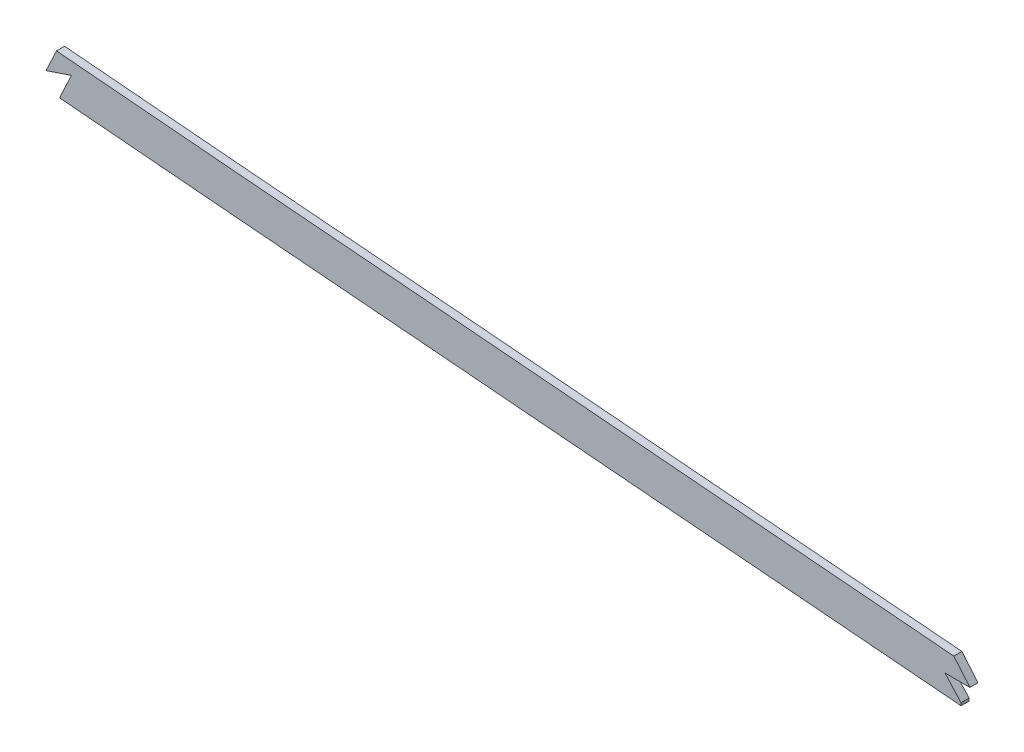
ISO-10303-21;
HEADER;
FILE_DESCRIPTION(('STEP AP214'),'2;1');
FILE_NAME('part.step','',(''),(''),'','','');
FILE_SCHEMA(('AUTOMOTIVE_DESIGN { 1 0 10303 214 1 1 1 1 }'));
ENDSEC;
DATA;
#1=APPLICATION_CONTEXT('core data for automotive mechanical design processes');
#2=APPLICATION_PROTOCOL_DEFINITION('international standard','automotive_design',2000,#1);
#3=PRODUCT_CONTEXT('',#1,'mechanical');
#4=PRODUCT('Part','Part','',(#3));
#5=PRODUCT_RELATED_PRODUCT_CATEGORY('part','',(#4));
#6=PRODUCT_DEFINITION_FORMATION('','',#4);
#7=PRODUCT_DEFINITION_CONTEXT('part definition',#1,'design');
#8=PRODUCT_DEFINITION('design','',#6,#7);
#9=PRODUCT_DEFINITION_SHAPE('','',#8);
#10=(LENGTH_UNIT() NAMED_UNIT(*) SI_UNIT(.MILLI.,.METRE.));
#11=(NAMED_UNIT(*) PLANE_ANGLE_UNIT() SI_UNIT($,.RADIAN.));
#12=(NAMED_UNIT(*) SI_UNIT($,.STERADIAN.) SOLID_ANGLE_UNIT());
#13=UNCERTAINTY_MEASURE_WITH_UNIT(LENGTH_MEASURE(1.E-05),#10,'distance_accuracy_value','');
#14=(GEOMETRIC_REPRESENTATION_CONTEXT(3) GLOBAL_UNCERTAINTY_ASSIGNED_CONTEXT((#13)) GLOBAL_UNIT_ASSIGNED_CONTEXT((#10,
#11,#12)) REPRESENTATION_CONTEXT('',''));
#15=CARTESIAN_POINT('',(0.,0.,0.));
#16=DIRECTION('',(0.,0.,1.));
#17=DIRECTION('',(1.,0.,0.));
#18=AXIS2_PLACEMENT_3D('',#15,#16,#17);
#19=CARTESIAN_POINT('',(816.035490090419,249.602504502473,1.5875));
#20=CARTESIAN_POINT('',(820.895958915978,248.948752998504,1.5875));
#21=CARTESIAN_POINT('',(830.611237516535,247.699685180795,1.5875));
#22=CARTESIAN_POINT('',(845.281067269815,245.953419482549,1.5875));
#23=CARTESIAN_POINT('',(860.086531547022,244.295598067093,1.5875));
#24=CARTESIAN_POINT('',(879.83070343434,242.186646027517,1.5875));
#25=CARTESIAN_POINT('',(904.36996709185,239.698279805688,1.5875));
#26=CARTESIAN_POINT('',(933.571022669327,236.832150625483,1.5875));
#27=CARTESIAN_POINT('',(962.642718040815,234.023667740898,1.5875));
#28=CARTESIAN_POINT('',(991.762593942944,231.241975908087,1.5875));
#29=CARTESIAN_POINT('',(1021.07201031471,228.475862291185,1.5875));
#30=CARTESIAN_POINT('',(1060.37643731472,224.796956681051,1.5875));
#31=CARTESIAN_POINT('',(1109.51301557685,220.18437886172,1.5875));
#32=CARTESIAN_POINT('',(1168.51119036116,214.817071985159,1.5875));
#33=CARTESIAN_POINT('',(1227.50012979269,209.662054041939,1.5875));
#34=CARTESIAN_POINT('',(1306.13316794657,203.021178328389,1.5875));
#35=CARTESIAN_POINT('',(1404.36147710547,194.920725932278,1.5875));
#36=CARTESIAN_POINT('',(1522.23985107062,184.918066624094,1.5875));
#37=CARTESIAN_POINT('',(1640.18285649102,175.16700778633,1.5875));
#38=CARTESIAN_POINT('',(1758.16535256682,165.7576394845,1.5875));
#39=CARTESIAN_POINT('',(1876.15538476943,156.590937078959,1.5875));
#40=CARTESIAN_POINT('',(1994.08749188002,147.453250142139,1.5875));
#41=CARTESIAN_POINT('',(2092.26869206097,139.624216053351,1.5875));
#42=CARTESIAN_POINT('',(2170.74802904205,133.07965672904,1.5875));
#43=CARTESIAN_POINT('',(2219.77173097685,128.842227835716,1.5875));
#44=CARTESIAN_POINT('',(2258.98398824696,125.347211495477,1.5875));
#45=CARTESIAN_POINT('',(2288.37945753647,122.670854497073,1.5875));
#46=CARTESIAN_POINT('',(2317.81224311603,119.931729386451,1.5875));
#47=CARTESIAN_POINT('',(2347.55150917161,117.100365282643,1.5875));
#48=CARTESIAN_POINT('',(2377.15989972739,114.210118529692,1.5875));
#49=CARTESIAN_POINT('',(2406.46965385077,111.268968010355,1.5875));
#50=CARTESIAN_POINT('',(2435.81832605954,108.240091266207,1.5875));
#51=CARTESIAN_POINT('',(2474.91392826886,104.090158094027,1.5875));
#52=CARTESIAN_POINT('',(2523.71623221738,98.6932837654834,1.5875));
#53=CARTESIAN_POINT('',(2582.04188116328,91.9122953054182,1.5875));
#54=CARTESIAN_POINT('',(2640.07521554125,84.8575618799937,1.5875));
#55=CARTESIAN_POINT('',(2678.57418525121,79.9813997136137,1.5875));
#56=CARTESIAN_POINT('',(2697.83785996013,77.4903351724698,1.5875));
#57=B_SPLINE_CURVE_WITH_KNOTS('',3,(#19,#20,#21,#22,#23,#24,#25,#26,#27,#28,#29,#30,#31,#32,#33,
#34,#35,#36,#37,#38,#39,#40,#41,#42,#43,#44,#45,#46,#47,#48,#49,#50,#51,#52,#53,#54,#55,#56),
.UNSPECIFIED.,.F.,.F.,(4,1,1,1,1,1,1,1,1,1,1,1,1,1,1,1,1,1,1,1,1,1,1,1,1,1,1,1,1,1,1,1,1,1,1,4),
(77.9308215150932,79.3861761032565,80.8415306914199,82.2968852795832,83.7522398677466,
86.6629490440732,89.5736582203999,92.4843673967266,95.3950765730532,98.3057857493799,
101.216494925707,107.03791327836,112.859331631013,118.680749983667,124.50216833632,
136.145005041627,147.787841746933,159.43067845224,171.073515157547,182.716351862853,
194.35918856816,206.002025273467,211.82344362612,217.644861978773,220.5555711551,
223.466280331427,226.376989507753,229.28769868408,232.198407860407,235.109117036733,
238.01982621306,240.930535389387,246.75195374204,252.573372094693,258.394790447347,264.2162088),.UNSPECIFIED.);
#58=DIRECTION('',(0.,0.,-1.));
#59=VECTOR('',#58,1.);
#60=SURFACE_OF_LINEAR_EXTRUSION('',#57,#59);
#61=CARTESIAN_POINT('',(1203.04497114067,211.807480637657,1.5875));
#62=VERTEX_POINT('',#61);
#63=CARTESIAN_POINT('',(1557.61112843577,182.009957183619,1.5875));
#64=VERTEX_POINT('',#63);
#65=EDGE_CURVE('E261',#62,#64,#57,.T.);
#66=ORIENTED_EDGE('',*,*,#65,.F.);
#67=DIRECTION('',(0.,0.,-1.));
#68=VECTOR('',#67,1.);
#69=CARTESIAN_POINT('',(1203.04497114067,211.807480638492,1.5875));
#70=LINE('',#69,#68);
#71=CARTESIAN_POINT('',(1203.04497114067,211.807480637657,-1.5875));
#72=VERTEX_POINT('',#71);
#73=EDGE_CURVE('E135',#62,#72,#70,.T.);
#74=ORIENTED_EDGE('',*,*,#73,.T.);
#75=CARTESIAN_POINT('',(816.035490090419,249.602504502473,-1.5875));
#76=CARTESIAN_POINT('',(820.895958915978,248.948752998504,-1.5875));
#77=CARTESIAN_POINT('',(830.611237516535,247.699685180795,-1.5875));
#78=CARTESIAN_POINT('',(845.281067269815,245.953419482549,-1.5875));
#79=CARTESIAN_POINT('',(860.086531547022,244.295598067093,-1.5875));
#80=CARTESIAN_POINT('',(879.83070343434,242.186646027517,-1.5875));
#81=CARTESIAN_POINT('',(904.36996709185,239.698279805688,-1.5875));
#82=CARTESIAN_POINT('',(933.571022669327,236.832150625483,-1.5875));
#83=CARTESIAN_POINT('',(962.642718040815,234.023667740898,-1.5875));
#84=CARTESIAN_POINT('',(991.762593942944,231.241975908087,-1.5875));
#85=CARTESIAN_POINT('',(1021.07201031471,228.475862291185,-1.5875));
#86=CARTESIAN_POINT('',(1060.37643731472,224.796956681051,-1.5875));
#87=CARTESIAN_POINT('',(1109.51301557685,220.18437886172,-1.5875));
#88=CARTESIAN_POINT('',(1168.51119036116,214.817071985159,-1.5875));
#89=CARTESIAN_POINT('',(1227.50012979269,209.662054041939,-1.5875));
#90=CARTESIAN_POINT('',(1306.13316794657,203.021178328389,-1.5875));
#91=CARTESIAN_POINT('',(1404.36147710547,194.920725932278,-1.5875));
#92=CARTESIAN_POINT('',(1522.23985107062,184.918066624094,-1.5875));
#93=CARTESIAN_POINT('',(1640.18285649102,175.16700778633,-1.5875));
#94=CARTESIAN_POINT('',(1758.16535256682,165.7576394845,-1.5875));
#95=CARTESIAN_POINT('',(1876.15538476943,156.590937078959,-1.5875));
#96=CARTESIAN_POINT('',(1994.08749188002,147.453250142139,-1.5875));
#97=CARTESIAN_POINT('',(2092.26869206097,139.624216053351,-1.5875));
#98=CARTESIAN_POINT('',(2170.74802904205,133.07965672904,-1.5875));
#99=CARTESIAN_POINT('',(2219.77173097685,128.842227835716,-1.5875));
#100=CARTESIAN_POINT('',(2258.98398824696,125.347211495477,-1.5875));
#101=CARTESIAN_POINT('',(2288.37945753647,122.670854497073,-1.5875));
#102=CARTESIAN_POINT('',(2317.81224311603,119.931729386451,-1.5875));
#103=CARTESIAN_POINT('',(2347.55150917161,117.100365282643,-1.5875));
#104=CARTESIAN_POINT('',(2377.15989972739,114.210118529692,-1.5875));
#105=CARTESIAN_POINT('',(2406.46965385077,111.268968010355,-1.5875));
#106=CARTESIAN_POINT('',(2435.81832605954,108.240091266207,-1.5875));
#107=CARTESIAN_POINT('',(2474.91392826886,104.090158094027,-1.5875));
#108=CARTESIAN_POINT('',(2523.71623221738,98.6932837654834,-1.5875));
#109=CARTESIAN_POINT('',(2582.04188116328,91.9122953054182,-1.5875));
#110=CARTESIAN_POINT('',(2640.07521554125,84.8575618799937,-1.5875));
#111=CARTESIAN_POINT('',(2678.57418525121,79.9813997136137,-1.5875));
#112=CARTESIAN_POINT('',(2697.83785996013,77.4903351724698,-1.5875));
#113=B_SPLINE_CURVE_WITH_KNOTS('',3,(#75,#76,#77,#78,#79,#80,#81,#82,#83,#84,#85,#86,#87,#88,
#89,#90,#91,#92,#93,#94,#95,#96,#97,#98,#99,#100,#101,#102,#103,#104,#105,#106,#107,#108,#109,
#110,#111,#112),.UNSPECIFIED.,.F.,.F.,(4,1,1,1,1,1,1,1,1,1,1,1,1,1,1,1,1,1,1,1,1,1,1,1,1,1,1,1,
1,1,1,1,1,1,1,4),(77.9308215150932,79.3861761032565,80.8415306914199,82.2968852795832,
83.7522398677466,86.6629490440732,89.5736582203999,92.4843673967266,95.3950765730532,
98.3057857493799,101.216494925707,107.03791327836,112.859331631013,118.680749983667,
124.50216833632,136.145005041627,147.787841746933,159.43067845224,171.073515157547,
182.716351862853,194.35918856816,206.002025273467,211.82344362612,217.644861978773,
220.5555711551,223.466280331427,226.376989507753,229.28769868408,232.198407860407,
235.109117036733,238.01982621306,240.930535389387,246.75195374204,252.573372094693,
258.394790447347,264.2162088),.UNSPECIFIED.);
#114=CARTESIAN_POINT('',(1557.61112843577,182.009957183619,-1.5875));
#115=VERTEX_POINT('',#114);
#116=EDGE_CURVE('E265',#72,#115,#113,.T.);
#117=ORIENTED_EDGE('',*,*,#116,.T.);
#118=DIRECTION('',(0.,0.,-1.));
#119=VECTOR('',#118,1.);
#120=CARTESIAN_POINT('',(1557.61112843577,182.009957183619,1.5875));
#121=LINE('',#120,#119);
#122=EDGE_CURVE('E186',#64,#115,#121,.T.);
#123=ORIENTED_EDGE('',*,*,#122,.F.);
#124=EDGE_LOOP('',(#66,#74,#117,#123));
#125=FACE_BOUND('',#124,.T.);
#126=ADVANCED_FACE('F40',(#125),#60,.F.);
#127=CARTESIAN_POINT('',(818.067033698442,264.706491743222,1.5875));
#128=CARTESIAN_POINT('',(827.043059883077,263.499182154688,1.5875));
#129=CARTESIAN_POINT('',(836.029088262746,262.37336018535,1.5875));
#130=CARTESIAN_POINT('',(845.086758911477,261.305822737124,1.5875));
#131=CARTESIAN_POINT('',(891.386485356828,256.087047064925,1.5875));
#132=CARTESIAN_POINT('',(937.686211733138,251.779150949417,1.5875));
#133=CARTESIAN_POINT('',(973.452075064018,248.227669424888,1.5875));
#134=CARTESIAN_POINT('',(1071.94667214103,239.051054037575,1.5875));
#135=CARTESIAN_POINT('',(1170.4412693194,229.731506737662,1.5875));
#136=CARTESIAN_POINT('',(1231.79194034372,224.503945812963,1.5875));
#137=CARTESIAN_POINT('',(1324.89933614602,216.790627817024,1.5875));
#138=CARTESIAN_POINT('',(1418.00673093479,209.040117977579,1.5875));
#139=CARTESIAN_POINT('',(1449.7429359212,206.361809936344,1.5875));
#140=CARTESIAN_POINT('',(1636.92860677809,190.521130341518,1.5875));
#141=CARTESIAN_POINT('',(1824.11427763497,175.409157235081,1.5875));
#142=CARTESIAN_POINT('',(1979.96694737597,164.299650252625,1.5875));
#143=CARTESIAN_POINT('',(2156.26863942885,150.414433314205,1.5875));
#144=CARTESIAN_POINT('',(2332.5703304682,133.85721640186,1.5875));
#145=CARTESIAN_POINT('',(2354.21298315715,131.785082220072,1.5875));
#146=CARTESIAN_POINT('',(2436.3555443117,123.723952135345,1.5875));
#147=CARTESIAN_POINT('',(2518.49810546626,114.859112916573,1.5875));
#148=CARTESIAN_POINT('',(2579.48130742255,107.74251493933,1.5875));
#149=CARTESIAN_POINT('',(2639.63682069028,100.383443901382,1.5875));
#150=CARTESIAN_POINT('',(2699.79233294449,92.6044886503654,1.5875));
#151=(BOUNDED_CURVE() B_SPLINE_CURVE(5,(#127,#128,#129,#130,#131,#132,#133,#134,#135,#136,#137,
#138,#139,#140,#141,#142,#143,#144,#145,#146,#147,#148,#149,#150),.UNSPECIFIED.,.F.,
.F.) B_SPLINE_CURVE_WITH_KNOTS((6,3,3,3,3,3,3,6),(77.9308215150932,82.46579272,100.7932901,
131.0989539,146.7691983,223.5339586,233.9431167,264.2162088),
.UNSPECIFIED.) CURVE() GEOMETRIC_REPRESENTATION_ITEM() RATIONAL_B_SPLINE_CURVE((1.,1.,1.,1.,1.,
1.,1.,1.,1.,1.,1.,1.,1.,1.,1.,1.,1.,1.,1.,1.,1.,1.,1.,1.)) REPRESENTATION_ITEM(''));
#152=DIRECTION('',(0.,0.,-1.));
#153=VECTOR('',#152,1.);
#154=SURFACE_OF_LINEAR_EXTRUSION('',#151,#153);
#155=CARTESIAN_POINT('',(1554.78174357075,197.536946322116,-1.5875));
#156=CARTESIAN_POINT('',(1546.46699311413,198.228571916108,-1.5875));
#157=CARTESIAN_POINT('',(1538.15239316728,198.921982172551,-1.5875));
#158=CARTESIAN_POINT('',(1529.83790416157,199.61708856515,-1.5875));
#159=CARTESIAN_POINT('',(1489.79042004138,202.972771867229,-1.5875));
#160=CARTESIAN_POINT('',(1449.7429359212,206.361809936344,-1.5875));
#161=CARTESIAN_POINT('',(1418.00673093479,209.040117977579,-1.5875));
#162=CARTESIAN_POINT('',(1355.69113438274,214.227435755326,-1.5875));
#163=CARTESIAN_POINT('',(1293.37553737668,219.398093614682,-1.5875));
#164=CARTESIAN_POINT('',(1262.79705998735,221.951288622832,-1.5875));
#165=CARTESIAN_POINT('',(1232.21975386952,224.557002042433,-1.5875));
#166=CARTESIAN_POINT('',(1201.64212049867,227.227691431805,-1.5875));
#167=(BOUNDED_CURVE() B_SPLINE_CURVE(5,(#155,#156,#157,#158,#159,#160,#161,#162,#163,#164,#165,
#166),.UNSPECIFIED.,.F.,.F.) B_SPLINE_CURVE_WITH_KNOTS((6,3,3,6),(115.998106991893,
120.103892273688,135.774136673688,150.874983581795),
.UNSPECIFIED.) CURVE() GEOMETRIC_REPRESENTATION_ITEM() RATIONAL_B_SPLINE_CURVE((1.,1.,1.,1.,1.,
1.,1.,1.,1.,1.,1.,1.)) REPRESENTATION_ITEM(''));
#168=CARTESIAN_POINT('',(1201.64204831692,227.228175466422,-1.5875));
#169=VERTEX_POINT('',#168);
#170=CARTESIAN_POINT('',(1554.78172827208,197.536981517301,-1.5875));
#171=VERTEX_POINT('',#170);
#172=EDGE_CURVE('E273',#169,#171,#167,.F.);
#173=ORIENTED_EDGE('',*,*,#172,.F.);
#174=CARTESIAN_POINT('',(1201.64185894077,227.227714276607,-1.5875));
#175=DIRECTION('',(0.,0.,1.));
#176=VECTOR('',#175,1.);
#177=LINE('',#174,#176);
#178=CARTESIAN_POINT('',(1201.64219509746,227.228546178045,1.5875));
#179=VERTEX_POINT('',#178);
#180=EDGE_CURVE('E191',#169,#179,#177,.T.);
#181=ORIENTED_EDGE('',*,*,#180,.T.);
#182=CARTESIAN_POINT('',(1201.64212041066,227.227691439492,1.5875));
#183=CARTESIAN_POINT('',(1232.21975379911,224.557002048433,1.5875));
#184=CARTESIAN_POINT('',(1262.79705993454,221.951288627241,1.5875));
#185=CARTESIAN_POINT('',(1293.37553734147,219.398093617603,1.5875));
#186=CARTESIAN_POINT('',(1355.69113436513,214.227435756792,1.5875));
#187=CARTESIAN_POINT('',(1418.00673093479,209.040117977579,1.5875));
#188=CARTESIAN_POINT('',(1449.7429359212,206.361809936344,1.5875));
#189=CARTESIAN_POINT('',(1489.79041948998,202.972771913892,1.5875));
#190=CARTESIAN_POINT('',(1529.83790305876,199.617088657558,1.5875));
#191=CARTESIAN_POINT('',(1538.15239151305,198.921982310848,1.5875));
#192=CARTESIAN_POINT('',(1546.46699090846,198.228572100053,1.5875));
#193=CARTESIAN_POINT('',(1554.78174081361,197.536946551456,1.5875));
#194=(BOUNDED_CURVE() B_SPLINE_CURVE(5,(#182,#183,#184,#185,#186,#187,#188,#189,#190,#191,#192,
#193),.UNSPECIFIED.,.F.,.F.) B_SPLINE_CURVE_WITH_KNOTS((6,3,3,6),(115.9981069832,131.0989539,
146.7691983,150.874983309503),
.UNSPECIFIED.) CURVE() GEOMETRIC_REPRESENTATION_ITEM() RATIONAL_B_SPLINE_CURVE((1.,1.,1.,1.,1.,
1.,1.,1.,1.,1.,1.,1.)) REPRESENTATION_ITEM(''));
#195=CARTESIAN_POINT('',(1554.78174084528,197.536946932136,1.5875));
#196=VERTEX_POINT('',#195);
#197=EDGE_CURVE('E239',#179,#196,#194,.T.);
#198=ORIENTED_EDGE('',*,*,#197,.T.);
#199=CARTESIAN_POINT('',(1554.78177425715,197.536943769604,1.5875));
#200=DIRECTION('',(0.,0.,-1.));
#201=VECTOR('',#200,1.);
#202=LINE('',#199,#201);
#203=EDGE_CURVE('E155',#171,#196,#202,.F.);
#204=ORIENTED_EDGE('',*,*,#203,.F.);
#205=EDGE_LOOP('',(#173,#181,#198,#204));
#206=FACE_BOUND('',#205,.T.);
#207=ADVANCED_FACE('F217',(#206),#154,.T.);
#208=CARTESIAN_POINT('',(0.,0.,1.5875));
#209=DIRECTION('',(0.,0.,1.));
#210=DIRECTION('',(1.,0.,0.));
#211=AXIS2_PLACEMENT_3D('',#208,#209,#210);
#212=PLANE('',#211);
#213=ORIENTED_EDGE('',*,*,#197,.F.);
#214=DIRECTION('',(-0.426005239002973,-0.904720695210417,0.));
#215=VECTOR('',#214,1.);
#216=CARTESIAN_POINT('',(1201.64190146374,227.227804562421,1.5875));
#217=LINE('',#216,#215);
#218=CARTESIAN_POINT('',(1197.50857174933,218.449722533425,1.5875));
#219=VERTEX_POINT('',#218);
#220=EDGE_CURVE('E129',#179,#219,#217,.T.);
#221=ORIENTED_EDGE('',*,*,#220,.T.);
#222=DIRECTION('',(0.947648212829273,0.319316245627254,0.));
#223=VECTOR('',#222,1.);
#224=CARTESIAN_POINT('',(1197.50857174933,218.449722533425,1.5875));
#225=LINE('',#224,#223);
#226=CARTESIAN_POINT('',(1207.4958020239,221.814984908549,1.5875));
#227=VERTEX_POINT('',#226);
#228=EDGE_CURVE('E146',#219,#227,#225,.T.);
#229=ORIENTED_EDGE('',*,*,#228,.T.);
#230=DIRECTION('',(-0.422321486152188,-0.906446116619299,0.));
#231=VECTOR('',#230,1.);
#232=CARTESIAN_POINT('',(1207.4958020239,221.814984908549,1.5875));
#233=LINE('',#232,#231);
#234=CARTESIAN_POINT('',(1203.04497114067,212.261982037228,1.5875));
#235=VERTEX_POINT('',#234);
#236=EDGE_CURVE('E122',#227,#235,#233,.T.);
#237=ORIENTED_EDGE('',*,*,#236,.T.);
#238=DIRECTION('',(0.,1.,0.));
#239=VECTOR('',#238,1.);
#240=CARTESIAN_POINT('',(1203.04497114067,207.573021891772,1.5875));
#241=LINE('',#240,#239);
#242=EDGE_CURVE('E132',#62,#235,#241,.T.);
#243=ORIENTED_EDGE('',*,*,#242,.F.);
#244=ORIENTED_EDGE('',*,*,#65,.T.);
#245=DIRECTION('',(0.,1.,0.));
#246=VECTOR('',#245,1.);
#247=CARTESIAN_POINT('',(1557.61112843577,178.064185515944,1.5875));
#248=LINE('',#247,#246);
#249=CARTESIAN_POINT('',(1557.61112843577,183.06357711347,1.5875));
#250=VERTEX_POINT('',#249);
#251=EDGE_CURVE('E140',#64,#250,#248,.T.);
#252=ORIENTED_EDGE('',*,*,#251,.T.);
#253=DIRECTION('',(0.670744430287446,-0.741688552721673,0.));
#254=VECTOR('',#253,1.);
#255=CARTESIAN_POINT('',(1551.31180898219,190.029170740031,1.5875));
#256=LINE('',#255,#254);
#257=CARTESIAN_POINT('',(1551.31180898219,190.029170740031,1.5875));
#258=VERTEX_POINT('',#257);
#259=EDGE_CURVE('E171',#258,#250,#256,.T.);
#260=ORIENTED_EDGE('',*,*,#259,.F.);
#261=DIRECTION('',(-1.,0.,0.));
#262=VECTOR('',#261,1.);
#263=CARTESIAN_POINT('',(1561.12421043873,190.029170740031,1.5875));
#264=LINE('',#263,#262);
#265=CARTESIAN_POINT('',(1561.12421043873,190.029170740031,1.5875));
#266=VERTEX_POINT('',#265);
#267=EDGE_CURVE('E167',#266,#258,#264,.T.);
#268=ORIENTED_EDGE('',*,*,#267,.F.);
#269=DIRECTION('',(0.645331605709328,-0.7639025583624,0.));
#270=VECTOR('',#269,1.);
#271=CARTESIAN_POINT('',(1554.7817129433,197.537016350415,1.5875));
#272=LINE('',#271,#270);
#273=EDGE_CURVE('E166',#196,#266,#272,.T.);
#274=ORIENTED_EDGE('',*,*,#273,.F.);
#275=EDGE_LOOP('',(#213,#221,#229,#237,#243,#244,#252,#260,#268,#274));
#276=FACE_BOUND('',#275,.T.);
#277=ADVANCED_FACE('F143',(#276),#212,.T.);
#278=CARTESIAN_POINT('',(0.,0.,-1.5875));
#279=DIRECTION('',(0.,0.,1.));
#280=DIRECTION('',(1.,0.,0.));
#281=AXIS2_PLACEMENT_3D('',#278,#279,#280);
#282=PLANE('',#281);
#283=DIRECTION('',(-0.426005239002973,-0.904720695210417,0.));
#284=VECTOR('',#283,1.);
#285=CARTESIAN_POINT('',(895.990195956948,-421.894314558801,-1.5875));
#286=LINE('',#285,#284);
#287=CARTESIAN_POINT('',(1197.50857174933,218.449722533425,-1.5875));
#288=VERTEX_POINT('',#287);
#289=EDGE_CURVE('E11',#169,#288,#286,.T.);
#290=ORIENTED_EDGE('',*,*,#289,.F.);
#291=ORIENTED_EDGE('',*,*,#172,.T.);
#292=DIRECTION('',(0.645331605709328,-0.7639025583624,0.));
#293=VECTOR('',#292,1.);
#294=CARTESIAN_POINT('',(1004.66830347762,848.726322999037,-1.5875));
#295=LINE('',#294,#293);
#296=CARTESIAN_POINT('',(1561.12421043873,190.029170740031,-1.5875));
#297=VERTEX_POINT('',#296);
#298=EDGE_CURVE('E311',#171,#297,#295,.T.);
#299=ORIENTED_EDGE('',*,*,#298,.T.);
#300=DIRECTION('',(-1.,0.,0.));
#301=VECTOR('',#300,1.);
#302=CARTESIAN_POINT('',(0.,190.029170740031,-1.5875));
#303=LINE('',#302,#301);
#304=CARTESIAN_POINT('',(1551.31180898219,190.029170740031,-1.5875));
#305=VERTEX_POINT('',#304);
#306=EDGE_CURVE('E307',#297,#305,#303,.T.);
#307=ORIENTED_EDGE('',*,*,#306,.T.);
#308=DIRECTION('',(0.670744430287446,-0.741688552721673,0.));
#309=VECTOR('',#308,1.);
#310=CARTESIAN_POINT('',(947.915958397723,857.24573629014,-1.5875));
#311=LINE('',#310,#309);
#312=CARTESIAN_POINT('',(1557.61112843577,183.06357711347,-1.5875));
#313=VERTEX_POINT('',#312);
#314=EDGE_CURVE('E303',#305,#313,#311,.T.);
#315=ORIENTED_EDGE('',*,*,#314,.T.);
#316=DIRECTION('',(0.,1.,0.));
#317=VECTOR('',#316,1.);
#318=CARTESIAN_POINT('',(1557.61112843577,0.,-1.5875));
#319=LINE('',#318,#317);
#320=EDGE_CURVE('E300',#115,#313,#319,.T.);
#321=ORIENTED_EDGE('',*,*,#320,.F.);
#322=ORIENTED_EDGE('',*,*,#116,.F.);
#323=DIRECTION('',(0.,1.,0.));
#324=VECTOR('',#323,1.);
#325=CARTESIAN_POINT('',(1203.04497114067,0.,-1.5875));
#326=LINE('',#325,#324);
#327=CARTESIAN_POINT('',(1203.04497114067,212.261982037228,-1.5875));
#328=VERTEX_POINT('',#327);
#329=EDGE_CURVE('E294',#72,#328,#326,.T.);
#330=ORIENTED_EDGE('',*,*,#329,.T.);
#331=DIRECTION('',(-0.422321486152188,-0.906446116619299,0.));
#332=VECTOR('',#331,1.);
#333=CARTESIAN_POINT('',(907.218994729217,-422.681577089763,-1.5875));
#334=LINE('',#333,#332);
#335=CARTESIAN_POINT('',(1207.4958020239,221.814984908549,-1.5875));
#336=VERTEX_POINT('',#335);
#337=EDGE_CURVE('E125',#336,#328,#334,.T.);
#338=ORIENTED_EDGE('',*,*,#337,.F.);
#339=DIRECTION('',(0.947648212829273,0.319316245627254,0.));
#340=VECTOR('',#339,1.);
#341=CARTESIAN_POINT('',(55.9986343539285,-166.189495501982,-1.5875));
#342=LINE('',#341,#340);
#343=EDGE_CURVE('E51',#288,#336,#342,.T.);
#344=ORIENTED_EDGE('',*,*,#343,.F.);
#345=EDGE_LOOP('',(#290,#291,#299,#307,#315,#321,#322,#330,#338,#344));
#346=FACE_BOUND('',#345,.T.);
#347=ADVANCED_FACE('F216',(#346),#282,.F.);
#348=CARTESIAN_POINT('',(1557.61112843577,178.064185515944,-6.0325));
#349=DIRECTION('',(1.,0.,0.));
#350=DIRECTION('',(0.,0.,-1.));
#351=AXIS2_PLACEMENT_3D('',#348,#349,#350);
#352=PLANE('',#351);
#353=ORIENTED_EDGE('',*,*,#122,.T.);
#354=ORIENTED_EDGE('',*,*,#320,.T.);
#355=DIRECTION('',(0.,0.,1.));
#356=VECTOR('',#355,1.);
#357=CARTESIAN_POINT('',(1557.61112843577,183.06357711347,-6.0325));
#358=LINE('',#357,#356);
#359=EDGE_CURVE('E158',#313,#250,#358,.T.);
#360=ORIENTED_EDGE('',*,*,#359,.T.);
#361=ORIENTED_EDGE('',*,*,#251,.F.);
#362=EDGE_LOOP('',(#353,#354,#360,#361));
#363=FACE_BOUND('',#362,.T.);
#364=ADVANCED_FACE('F327',(#363),#352,.T.);
#365=CARTESIAN_POINT('',(1551.31180898219,190.029170740031,-6.0325));
#366=DIRECTION('',(-0.741688552721673,-0.670744430287446,0.));
#367=DIRECTION('',(0.670744430287446,-0.741688552721673,0.));
#368=AXIS2_PLACEMENT_3D('',#365,#366,#367);
#369=PLANE('',#368);
#370=DIRECTION('',(0.,0.,1.));
#371=VECTOR('',#370,1.);
#372=CARTESIAN_POINT('',(1551.31180898219,190.029170740031,-6.0325));
#373=LINE('',#372,#371);
#374=EDGE_CURVE('E161',#305,#258,#373,.T.);
#375=ORIENTED_EDGE('',*,*,#374,.T.);
#376=ORIENTED_EDGE('',*,*,#259,.T.);
#377=ORIENTED_EDGE('',*,*,#359,.F.);
#378=ORIENTED_EDGE('',*,*,#314,.F.);
#379=EDGE_LOOP('',(#375,#376,#377,#378));
#380=FACE_BOUND('',#379,.T.);
#381=ADVANCED_FACE('F331',(#380),#369,.F.);
#382=CARTESIAN_POINT('',(1561.12421043873,190.029170740031,-6.0325));
#383=DIRECTION('',(0.,1.,0.));
#384=DIRECTION('',(0.,0.,1.));
#385=AXIS2_PLACEMENT_3D('',#382,#383,#384);
#386=PLANE('',#385);
#387=DIRECTION('',(0.,0.,1.));
#388=VECTOR('',#387,1.);
#389=CARTESIAN_POINT('',(1561.12421043873,190.029170740031,-6.0325));
#390=LINE('',#389,#388);
#391=EDGE_CURVE('E67',#297,#266,#390,.T.);
#392=ORIENTED_EDGE('',*,*,#391,.T.);
#393=ORIENTED_EDGE('',*,*,#267,.T.);
#394=ORIENTED_EDGE('',*,*,#374,.F.);
#395=ORIENTED_EDGE('',*,*,#306,.F.);
#396=EDGE_LOOP('',(#392,#393,#394,#395));
#397=FACE_BOUND('',#396,.T.);
#398=ADVANCED_FACE('F211',(#397),#386,.F.);
#399=CARTESIAN_POINT('',(1554.7817129433,197.537016350415,-6.0325));
#400=DIRECTION('',(-0.7639025583624,-0.645331605709328,0.));
#401=DIRECTION('',(0.645331605709328,-0.7639025583624,0.));
#402=AXIS2_PLACEMENT_3D('',#399,#400,#401);
#403=PLANE('',#402);
#404=ORIENTED_EDGE('',*,*,#203,.T.);
#405=ORIENTED_EDGE('',*,*,#273,.T.);
#406=ORIENTED_EDGE('',*,*,#391,.F.);
#407=ORIENTED_EDGE('',*,*,#298,.F.);
#408=EDGE_LOOP('',(#404,#405,#406,#407));
#409=FACE_BOUND('',#408,.T.);
#410=ADVANCED_FACE('F200',(#409),#403,.F.);
#411=CARTESIAN_POINT('',(1201.64190146374,227.227804562421,-6.0325));
#412=DIRECTION('',(-0.904720695210417,0.426005239002973,0.));
#413=DIRECTION('',(-0.426005239002973,-0.904720695210417,0.));
#414=AXIS2_PLACEMENT_3D('',#411,#412,#413);
#415=PLANE('',#414);
#416=ORIENTED_EDGE('',*,*,#289,.T.);
#417=DIRECTION('',(0.,0.,1.));
#418=VECTOR('',#417,1.);
#419=CARTESIAN_POINT('',(1197.50857174933,218.449722533425,-6.0325));
#420=LINE('',#419,#418);
#421=EDGE_CURVE('E152',#288,#219,#420,.T.);
#422=ORIENTED_EDGE('',*,*,#421,.T.);
#423=ORIENTED_EDGE('',*,*,#220,.F.);
#424=ORIENTED_EDGE('',*,*,#180,.F.);
#425=EDGE_LOOP('',(#416,#422,#423,#424));
#426=FACE_BOUND('',#425,.T.);
#427=ADVANCED_FACE('F210',(#426),#415,.T.);
#428=CARTESIAN_POINT('',(1197.50857174933,218.449722533425,-6.0325));
#429=DIRECTION('',(0.319316245627254,-0.947648212829273,0.));
#430=DIRECTION('',(0.947648212829273,0.319316245627254,0.));
#431=AXIS2_PLACEMENT_3D('',#428,#429,#430);
#432=PLANE('',#431);
#433=ORIENTED_EDGE('',*,*,#343,.T.);
#434=DIRECTION('',(0.,0.,1.));
#435=VECTOR('',#434,1.);
#436=CARTESIAN_POINT('',(1207.4958020239,221.814984908549,-6.0325));
#437=LINE('',#436,#435);
#438=EDGE_CURVE('E128',#336,#227,#437,.T.);
#439=ORIENTED_EDGE('',*,*,#438,.T.);
#440=ORIENTED_EDGE('',*,*,#228,.F.);
#441=ORIENTED_EDGE('',*,*,#421,.F.);
#442=EDGE_LOOP('',(#433,#439,#440,#441));
#443=FACE_BOUND('',#442,.T.);
#444=ADVANCED_FACE('F383',(#443),#432,.T.);
#445=CARTESIAN_POINT('',(1207.4958020239,221.814984908549,-6.0325));
#446=DIRECTION('',(-0.906446116619299,0.422321486152188,0.));
#447=DIRECTION('',(-0.422321486152188,-0.906446116619299,0.));
#448=AXIS2_PLACEMENT_3D('',#445,#446,#447);
#449=PLANE('',#448);
#450=ORIENTED_EDGE('',*,*,#337,.T.);
#451=DIRECTION('',(0.,0.,1.));
#452=VECTOR('',#451,1.);
#453=CARTESIAN_POINT('',(1203.04497114067,212.261982037228,-6.0325));
#454=LINE('',#453,#452);
#455=EDGE_CURVE('E59',#328,#235,#454,.T.);
#456=ORIENTED_EDGE('',*,*,#455,.T.);
#457=ORIENTED_EDGE('',*,*,#236,.F.);
#458=ORIENTED_EDGE('',*,*,#438,.F.);
#459=EDGE_LOOP('',(#450,#456,#457,#458));
#460=FACE_BOUND('',#459,.T.);
#461=ADVANCED_FACE('F119',(#460),#449,.T.);
#462=CARTESIAN_POINT('',(1203.04497114067,207.573021891772,-6.0325));
#463=DIRECTION('',(1.,0.,0.));
#464=DIRECTION('',(0.,0.,-1.));
#465=AXIS2_PLACEMENT_3D('',#462,#463,#464);
#466=PLANE('',#465);
#467=ORIENTED_EDGE('',*,*,#242,.T.);
#468=ORIENTED_EDGE('',*,*,#455,.F.);
#469=ORIENTED_EDGE('',*,*,#329,.F.);
#470=ORIENTED_EDGE('',*,*,#73,.F.);
#471=EDGE_LOOP('',(#467,#468,#469,#470));
#472=FACE_BOUND('',#471,.T.);
#473=ADVANCED_FACE('F133',(#472),#466,.F.);
#474=CLOSED_SHELL('',(#126,#207,#277,#347,#364,#381,#398,#410,#427,#444,#461,#473));
#475=MANIFOLD_SOLID_BREP('B2',#474);
#476=ADVANCED_BREP_SHAPE_REPRESENTATION('',(#18,#475),#14);
#477=SHAPE_DEFINITION_REPRESENTATION(#9,#476);
ENDSEC;
END-ISO-10303-21;
